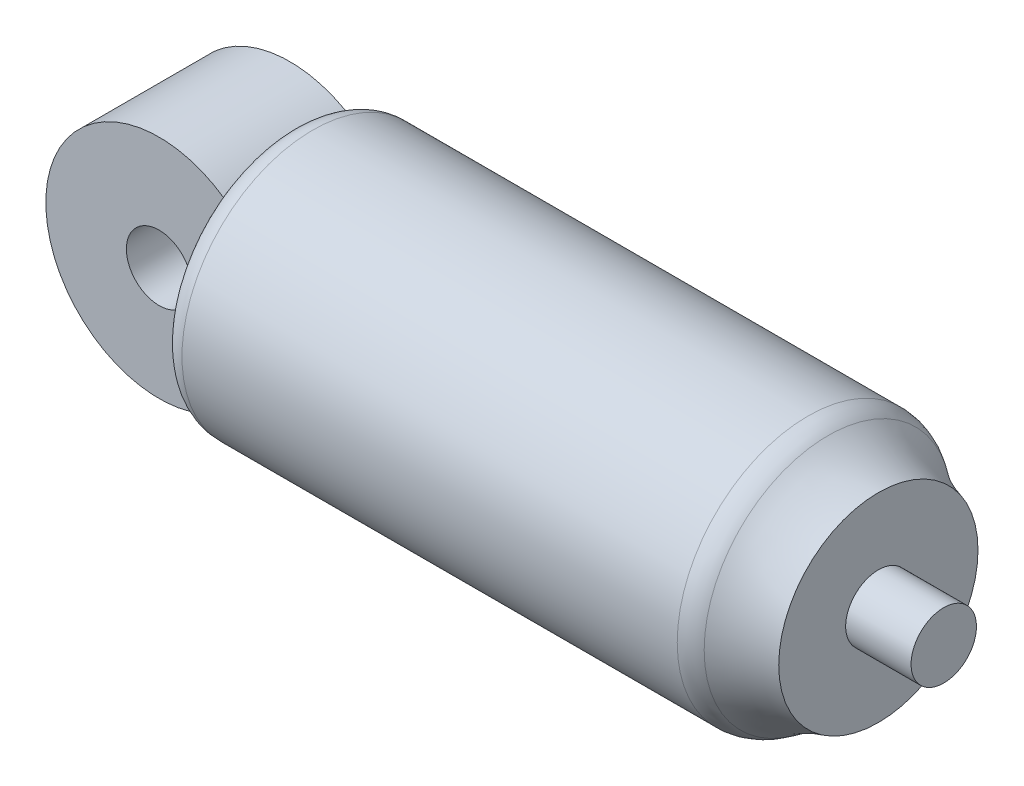
ISO-10303-21;
HEADER;
FILE_DESCRIPTION(('STEP AP214'),'2;1');
FILE_NAME('part.step','',(''),(''),'','','');
FILE_SCHEMA(('AUTOMOTIVE_DESIGN { 1 0 10303 214 1 1 1 1 }'));
ENDSEC;
DATA;
#1=APPLICATION_CONTEXT('core data for automotive mechanical design processes');
#2=APPLICATION_PROTOCOL_DEFINITION('international standard','automotive_design',2000,#1);
#3=PRODUCT_CONTEXT('',#1,'mechanical');
#4=PRODUCT('Part','Part','',(#3));
#5=PRODUCT_RELATED_PRODUCT_CATEGORY('part','',(#4));
#6=PRODUCT_DEFINITION_FORMATION('','',#4);
#7=PRODUCT_DEFINITION_CONTEXT('part definition',#1,'design');
#8=PRODUCT_DEFINITION('design','',#6,#7);
#9=PRODUCT_DEFINITION_SHAPE('','',#8);
#10=(LENGTH_UNIT() NAMED_UNIT(*) SI_UNIT(.MILLI.,.METRE.));
#11=(NAMED_UNIT(*) PLANE_ANGLE_UNIT() SI_UNIT($,.RADIAN.));
#12=(NAMED_UNIT(*) SI_UNIT($,.STERADIAN.) SOLID_ANGLE_UNIT());
#13=UNCERTAINTY_MEASURE_WITH_UNIT(LENGTH_MEASURE(1.E-05),#10,'distance_accuracy_value','');
#14=(GEOMETRIC_REPRESENTATION_CONTEXT(3) GLOBAL_UNCERTAINTY_ASSIGNED_CONTEXT((#13)) GLOBAL_UNIT_ASSIGNED_CONTEXT((#10,
#11,#12)) REPRESENTATION_CONTEXT('',''));
#15=CARTESIAN_POINT('',(0.,0.,0.));
#16=DIRECTION('',(0.,0.,1.));
#17=DIRECTION('',(1.,0.,0.));
#18=AXIS2_PLACEMENT_3D('',#15,#16,#17);
#19=CARTESIAN_POINT('',(20.,0.,20.));
#20=DIRECTION('',(1.,0.,0.));
#21=DIRECTION('',(0.,0.,-1.));
#22=AXIS2_PLACEMENT_3D('',#19,#20,#21);
#23=PLANE('',#22);
#24=DIRECTION('',(0.,1.,0.));
#25=VECTOR('',#24,1.);
#26=CARTESIAN_POINT('',(20.,0.,40.));
#27=LINE('',#26,#25);
#28=CARTESIAN_POINT('',(20.,-26.2488094968134,40.));
#29=VERTEX_POINT('',#28);
#30=CARTESIAN_POINT('',(20.,26.2488094968134,40.));
#31=VERTEX_POINT('',#30);
#32=EDGE_CURVE('E141',#29,#31,#27,.T.);
#33=ORIENTED_EDGE('',*,*,#32,.F.);
#34=CARTESIAN_POINT('',(20.,0.,20.));
#35=DIRECTION('',(1.,0.,0.));
#36=DIRECTION('',(0.,0.,-1.));
#37=AXIS2_PLACEMENT_3D('',#34,#35,#36);
#38=CIRCLE('',#37,33.);
#39=EDGE_CURVE('E173',#29,#31,#38,.F.);
#40=ORIENTED_EDGE('',*,*,#39,.T.);
#41=EDGE_LOOP('',(#33,#40));
#42=FACE_BOUND('',#41,.T.);
#43=ADVANCED_FACE('F44',(#42),#23,.F.);
#44=DIRECTION('',(0.,0.,-1.));
#45=VECTOR('',#44,1.);
#46=CARTESIAN_POINT('',(20.,28.2830267121466,40.));
#47=LINE('',#46,#45);
#48=CARTESIAN_POINT('',(20.,28.2830267121466,2.99792953784745));
#49=VERTEX_POINT('',#48);
#50=CARTESIAN_POINT('',(20.,28.2830267121466,37.0020704621526));
#51=VERTEX_POINT('',#50);
#52=EDGE_CURVE('E134',#49,#51,#47,.F.);
#53=ORIENTED_EDGE('',*,*,#52,.T.);
#54=CARTESIAN_POINT('',(20.,0.,20.));
#55=DIRECTION('',(1.,0.,0.));
#56=DIRECTION('',(0.,0.,-1.));
#57=AXIS2_PLACEMENT_3D('',#54,#55,#56);
#58=CIRCLE('',#57,33.);
#59=EDGE_CURVE('E171',#51,#49,#58,.F.);
#60=ORIENTED_EDGE('',*,*,#59,.T.);
#61=EDGE_LOOP('',(#53,#60));
#62=FACE_BOUND('',#61,.T.);
#63=ADVANCED_FACE('F256',(#62),#23,.F.);
#64=DIRECTION('',(0.,1.,0.));
#65=VECTOR('',#64,1.);
#66=CARTESIAN_POINT('',(20.,0.,0.));
#67=LINE('',#66,#65);
#68=CARTESIAN_POINT('',(20.,-26.2488094968134,0.));
#69=VERTEX_POINT('',#68);
#70=CARTESIAN_POINT('',(20.,26.2488094968134,0.));
#71=VERTEX_POINT('',#70);
#72=EDGE_CURVE('E150',#69,#71,#67,.T.);
#73=ORIENTED_EDGE('',*,*,#72,.T.);
#74=CARTESIAN_POINT('',(20.,0.,20.));
#75=DIRECTION('',(1.,0.,0.));
#76=DIRECTION('',(0.,0.,-1.));
#77=AXIS2_PLACEMENT_3D('',#74,#75,#76);
#78=CIRCLE('',#77,33.);
#79=EDGE_CURVE('E169',#71,#69,#78,.F.);
#80=ORIENTED_EDGE('',*,*,#79,.T.);
#81=EDGE_LOOP('',(#73,#80));
#82=FACE_BOUND('',#81,.T.);
#83=ADVANCED_FACE('F238',(#82),#23,.F.);
#84=CARTESIAN_POINT('',(20.,0.,20.));
#85=DIRECTION('',(1.,0.,0.));
#86=DIRECTION('',(0.,0.,-1.));
#87=AXIS2_PLACEMENT_3D('',#84,#85,#86);
#88=CYLINDRICAL_SURFACE('',#87,40.);
#89=CARTESIAN_POINT('',(27.,0.,20.));
#90=DIRECTION('',(1.,0.,0.));
#91=DIRECTION('',(0.,0.,-1.));
#92=AXIS2_PLACEMENT_3D('',#89,#90,#91);
#93=CIRCLE('',#92,40.);
#94=CARTESIAN_POINT('',(27.,0.,-20.));
#95=VERTEX_POINT('',#94);
#96=EDGE_CURVE('E164',#95,#95,#93,.T.);
#97=ORIENTED_EDGE('',*,*,#96,.T.);
#98=EDGE_LOOP('',(#97));
#99=FACE_BOUND('',#98,.T.);
#100=CARTESIAN_POINT('',(178.48120914175,0.,20.));
#101=DIRECTION('',(-1.,0.,0.));
#102=DIRECTION('',(0.,0.,1.));
#103=AXIS2_PLACEMENT_3D('',#100,#101,#102);
#104=CIRCLE('',#103,40.);
#105=CARTESIAN_POINT('',(178.48120914175,0.,60.));
#106=VERTEX_POINT('',#105);
#107=EDGE_CURVE('E161',#106,#106,#104,.T.);
#108=ORIENTED_EDGE('',*,*,#107,.T.);
#109=EDGE_LOOP('',(#108));
#110=FACE_BOUND('',#109,.T.);
#111=ADVANCED_FACE('F236',(#99,#110),#88,.T.);
#112=DIRECTION('',(0.,0.,-1.));
#113=VECTOR('',#112,1.);
#114=CARTESIAN_POINT('',(20.,-28.2830267121466,40.));
#115=LINE('',#114,#113);
#116=CARTESIAN_POINT('',(20.,-28.2830267121466,37.0020704621526));
#117=VERTEX_POINT('',#116);
#118=CARTESIAN_POINT('',(20.,-28.2830267121466,2.99792953784745));
#119=VERTEX_POINT('',#118);
#120=EDGE_CURVE('E147',#117,#119,#115,.T.);
#121=ORIENTED_EDGE('',*,*,#120,.T.);
#122=CARTESIAN_POINT('',(20.,0.,20.));
#123=DIRECTION('',(1.,0.,0.));
#124=DIRECTION('',(0.,0.,-1.));
#125=AXIS2_PLACEMENT_3D('',#122,#123,#124);
#126=CIRCLE('',#125,33.);
#127=EDGE_CURVE('E167',#119,#117,#126,.F.);
#128=ORIENTED_EDGE('',*,*,#127,.T.);
#129=EDGE_LOOP('',(#121,#128));
#130=FACE_BOUND('',#129,.T.);
#131=ADVANCED_FACE('F233',(#130),#23,.F.);
#132=CARTESIAN_POINT('',(40.,0.,0.));
#133=DIRECTION('',(-1.,0.,0.));
#134=DIRECTION('',(0.,0.,1.));
#135=AXIS2_PLACEMENT_3D('',#132,#133,#134);
#136=PLANE('',#135);
#137=DIRECTION('',(0.,-1.,0.));
#138=VECTOR('',#137,1.);
#139=CARTESIAN_POINT('',(40.,28.2830267121466,0.));
#140=LINE('',#139,#138);
#141=CARTESIAN_POINT('',(40.,28.2830267121466,0.));
#142=VERTEX_POINT('',#141);
#143=CARTESIAN_POINT('',(40.,-28.2830267121466,0.));
#144=VERTEX_POINT('',#143);
#145=EDGE_CURVE('E127',#142,#144,#140,.T.);
#146=ORIENTED_EDGE('',*,*,#145,.T.);
#147=DIRECTION('',(0.,0.,1.));
#148=VECTOR('',#147,1.);
#149=CARTESIAN_POINT('',(40.,-28.2830267121466,0.));
#150=LINE('',#149,#148);
#151=CARTESIAN_POINT('',(40.,-28.2830267121466,40.));
#152=VERTEX_POINT('',#151);
#153=EDGE_CURVE('E133',#144,#152,#150,.T.);
#154=ORIENTED_EDGE('',*,*,#153,.T.);
#155=DIRECTION('',(0.,1.,0.));
#156=VECTOR('',#155,1.);
#157=CARTESIAN_POINT('',(40.,28.2830267121466,40.));
#158=LINE('',#157,#156);
#159=CARTESIAN_POINT('',(40.,28.2830267121466,40.));
#160=VERTEX_POINT('',#159);
#161=EDGE_CURVE('E139',#152,#160,#158,.T.);
#162=ORIENTED_EDGE('',*,*,#161,.T.);
#163=DIRECTION('',(0.,0.,-1.));
#164=VECTOR('',#163,1.);
#165=CARTESIAN_POINT('',(40.,28.2830267121466,0.));
#166=LINE('',#165,#164);
#167=EDGE_CURVE('E121',#160,#142,#166,.T.);
#168=ORIENTED_EDGE('',*,*,#167,.T.);
#169=EDGE_LOOP('',(#146,#154,#162,#168));
#170=FACE_BOUND('',#169,.T.);
#171=ADVANCED_FACE('F137',(#170),#136,.T.);
#172=CARTESIAN_POINT('',(40.,-28.2830267121466,0.));
#173=DIRECTION('',(0.,-1.,0.));
#174=DIRECTION('',(0.,0.,-1.));
#175=AXIS2_PLACEMENT_3D('',#172,#173,#174);
#176=PLANE('',#175);
#177=DIRECTION('',(-1.,0.,0.));
#178=VECTOR('',#177,1.);
#179=CARTESIAN_POINT('',(40.,-28.2830267121466,0.));
#180=LINE('',#179,#178);
#181=CARTESIAN_POINT('',(20.1948254981962,-28.2830267121466,0.));
#182=VERTEX_POINT('',#181);
#183=EDGE_CURVE('E129',#144,#182,#180,.T.);
#184=ORIENTED_EDGE('',*,*,#183,.T.);
#185=CARTESIAN_POINT('',(20.1948254981962,-28.2830267121466,0.));
#186=CARTESIAN_POINT('',(20.160279238848,-28.2830267121466,0.248355444867538));
#187=CARTESIAN_POINT('',(20.1308419637385,-28.2830267121466,0.497386874252565));
#188=CARTESIAN_POINT('',(20.0814099693617,-28.2830267121466,0.996091238378469));
#189=CARTESIAN_POINT('',(20.0614040583334,-28.2830267121466,1.24576305749517));
#190=CARTESIAN_POINT('',(20.0299838221906,-28.2830267121466,1.74558608946365));
#191=CARTESIAN_POINT('',(20.0185679668843,-28.2830267121466,1.9957372089719));
#192=CARTESIAN_POINT('',(20.0035744241917,-28.2830267121466,2.49657628750591));
#193=CARTESIAN_POINT('',(20.0000060854123,-28.2830267121466,2.74726453109424));
#194=CARTESIAN_POINT('',(20.,-28.2830267121466,2.99792953784745));
#195=B_SPLINE_CURVE_WITH_KNOTS('',3,(#185,#186,#187,#188,#189,#190,#191,#192,#193,#194),
.UNSPECIFIED.,.F.,.F.,(4,2,2,2,4),(0.,0.752137689927841,1.50338059234582,2.25448964022429,
3.00649298735349),.UNSPECIFIED.);
#196=EDGE_CURVE('E49',#182,#119,#195,.T.);
#197=ORIENTED_EDGE('',*,*,#196,.T.);
#198=ORIENTED_EDGE('',*,*,#120,.F.);
#199=CARTESIAN_POINT('',(20.,-28.2830267121466,37.0020704621526));
#200=CARTESIAN_POINT('',(20.0000060854123,-28.2830267121466,37.2527354689058));
#201=CARTESIAN_POINT('',(20.0035744241917,-28.2830267121466,37.5034237124941));
#202=CARTESIAN_POINT('',(20.0185679668843,-28.2830267121466,38.0042627910281));
#203=CARTESIAN_POINT('',(20.0299838221906,-28.2830267121466,38.2544139105363));
#204=CARTESIAN_POINT('',(20.0614040583334,-28.2830267121466,38.7542369425048));
#205=CARTESIAN_POINT('',(20.0814099693617,-28.2830267121466,39.0039087616215));
#206=CARTESIAN_POINT('',(20.1308419637385,-28.2830267121466,39.5026131257474));
#207=CARTESIAN_POINT('',(20.160279238848,-28.2830267121466,39.7516445551325));
#208=CARTESIAN_POINT('',(20.1948254981962,-28.2830267121466,40.));
#209=B_SPLINE_CURVE_WITH_KNOTS('',3,(#199,#200,#201,#202,#203,#204,#205,#206,#207,#208),
.UNSPECIFIED.,.F.,.F.,(4,2,2,2,4),(0.,0.7520033471292,1.50311239500766,2.25435529742564,
3.00649298735349),.UNSPECIFIED.);
#210=CARTESIAN_POINT('',(20.1948254981962,-28.2830267121466,40.));
#211=VERTEX_POINT('',#210);
#212=EDGE_CURVE('E284',#117,#211,#209,.T.);
#213=ORIENTED_EDGE('',*,*,#212,.T.);
#214=DIRECTION('',(-1.,0.,0.));
#215=VECTOR('',#214,1.);
#216=CARTESIAN_POINT('',(40.,-28.2830267121466,40.));
#217=LINE('',#216,#215);
#218=EDGE_CURVE('E156',#152,#211,#217,.T.);
#219=ORIENTED_EDGE('',*,*,#218,.F.);
#220=ORIENTED_EDGE('',*,*,#153,.F.);
#221=EDGE_LOOP('',(#184,#197,#198,#213,#219,#220));
#222=FACE_BOUND('',#221,.T.);
#223=ADVANCED_FACE('F193',(#222),#176,.F.);
#224=CARTESIAN_POINT('',(40.,28.2830267121466,40.));
#225=DIRECTION('',(0.,0.,1.));
#226=DIRECTION('',(1.,0.,0.));
#227=AXIS2_PLACEMENT_3D('',#224,#225,#226);
#228=PLANE('',#227);
#229=ORIENTED_EDGE('',*,*,#32,.T.);
#230=CARTESIAN_POINT('',(20.,26.2488094968134,40.));
#231=CARTESIAN_POINT('',(20.0000004890266,26.4195581899161,40.));
#232=CARTESIAN_POINT('',(20.003952907949,26.5903159501761,40.));
#233=CARTESIAN_POINT('',(20.0199173343197,26.9310506482777,40.));
#234=CARTESIAN_POINT('',(20.0319103850597,27.1010284780561,40.));
#235=CARTESIAN_POINT('',(20.0641116427262,27.4402254462618,40.));
#236=CARTESIAN_POINT('',(20.0843205787439,27.6094445160077,40.));
#237=CARTESIAN_POINT('',(20.133182028721,27.9470642154494,40.));
#238=CARTESIAN_POINT('',(20.1618543162975,28.1154619790185,40.));
#239=CARTESIAN_POINT('',(20.1948254981962,28.2830267121466,40.));
#240=B_SPLINE_CURVE_WITH_KNOTS('',3,(#230,#231,#232,#233,#234,#235,#236,#237,#238,#239),
.UNSPECIFIED.,.F.,.F.,(4,2,2,2,4),(0.,0.512213453390982,1.0232235318383,1.53427896805816,
2.04653800535891),.UNSPECIFIED.);
#241=CARTESIAN_POINT('',(20.1948254981962,28.2830267121466,40.));
#242=VERTEX_POINT('',#241);
#243=EDGE_CURVE('E183',#31,#242,#240,.T.);
#244=ORIENTED_EDGE('',*,*,#243,.T.);
#245=DIRECTION('',(-1.,0.,0.));
#246=VECTOR('',#245,1.);
#247=CARTESIAN_POINT('',(40.,28.2830267121466,40.));
#248=LINE('',#247,#246);
#249=EDGE_CURVE('E124',#160,#242,#248,.T.);
#250=ORIENTED_EDGE('',*,*,#249,.F.);
#251=ORIENTED_EDGE('',*,*,#161,.F.);
#252=ORIENTED_EDGE('',*,*,#218,.T.);
#253=CARTESIAN_POINT('',(20.1948254981962,-28.2830267121466,40.));
#254=CARTESIAN_POINT('',(20.1618543162975,-28.1154619790185,40.));
#255=CARTESIAN_POINT('',(20.133182028721,-27.9470642154494,40.));
#256=CARTESIAN_POINT('',(20.0843205787439,-27.6094445160077,40.));
#257=CARTESIAN_POINT('',(20.0641116427262,-27.4402254462618,40.));
#258=CARTESIAN_POINT('',(20.0319103850597,-27.1010284780561,40.));
#259=CARTESIAN_POINT('',(20.0199173343197,-26.9310506482777,40.));
#260=CARTESIAN_POINT('',(20.003952907949,-26.5903159501761,40.));
#261=CARTESIAN_POINT('',(20.0000004890266,-26.4195581899161,40.));
#262=CARTESIAN_POINT('',(20.,-26.2488094968134,40.));
#263=B_SPLINE_CURVE_WITH_KNOTS('',3,(#253,#254,#255,#256,#257,#258,#259,#260,#261,#262),
.UNSPECIFIED.,.F.,.F.,(4,2,2,2,4),(0.,0.512259037300747,1.02331447352061,1.53432455196793,
2.04653800535891),.UNSPECIFIED.);
#264=EDGE_CURVE('E176',#211,#29,#263,.T.);
#265=ORIENTED_EDGE('',*,*,#264,.T.);
#266=EDGE_LOOP('',(#229,#244,#250,#251,#252,#265));
#267=FACE_BOUND('',#266,.T.);
#268=ADVANCED_FACE('F189',(#267),#228,.F.);
#269=CARTESIAN_POINT('',(40.,28.2830267121466,0.));
#270=DIRECTION('',(0.,1.,0.));
#271=DIRECTION('',(0.,0.,1.));
#272=AXIS2_PLACEMENT_3D('',#269,#270,#271);
#273=PLANE('',#272);
#274=ORIENTED_EDGE('',*,*,#249,.T.);
#275=CARTESIAN_POINT('',(20.1948254981962,28.2830267121466,40.));
#276=CARTESIAN_POINT('',(20.160279238848,28.2830267121466,39.7516445551325));
#277=CARTESIAN_POINT('',(20.1308419637385,28.2830267121466,39.5026131257474));
#278=CARTESIAN_POINT('',(20.0814099693617,28.2830267121466,39.0039087616215));
#279=CARTESIAN_POINT('',(20.0614040583334,28.2830267121466,38.7542369425048));
#280=CARTESIAN_POINT('',(20.0299838221906,28.2830267121466,38.2544139105363));
#281=CARTESIAN_POINT('',(20.0185679668843,28.2830267121466,38.0042627910281));
#282=CARTESIAN_POINT('',(20.0035744241917,28.2830267121466,37.5034237124941));
#283=CARTESIAN_POINT('',(20.0000060854123,28.2830267121466,37.2527354689058));
#284=CARTESIAN_POINT('',(20.,28.2830267121466,37.0020704621526));
#285=B_SPLINE_CURVE_WITH_KNOTS('',3,(#275,#276,#277,#278,#279,#280,#281,#282,#283,#284),
.UNSPECIFIED.,.F.,.F.,(4,2,2,2,4),(0.,0.752137689927853,1.50338059234583,2.25448964022429,
3.00649298735349),.UNSPECIFIED.);
#286=EDGE_CURVE('E207',#242,#51,#285,.T.);
#287=ORIENTED_EDGE('',*,*,#286,.T.);
#288=ORIENTED_EDGE('',*,*,#52,.F.);
#289=CARTESIAN_POINT('',(20.,28.2830267121466,2.99792953784745));
#290=CARTESIAN_POINT('',(20.0000060854123,28.2830267121466,2.74726453109424));
#291=CARTESIAN_POINT('',(20.0035744241917,28.2830267121466,2.49657628750591));
#292=CARTESIAN_POINT('',(20.0185679668843,28.2830267121466,1.9957372089719));
#293=CARTESIAN_POINT('',(20.0299838221906,28.2830267121466,1.74558608946365));
#294=CARTESIAN_POINT('',(20.0614040583334,28.2830267121466,1.24576305749517));
#295=CARTESIAN_POINT('',(20.0814099693617,28.2830267121466,0.996091238378469));
#296=CARTESIAN_POINT('',(20.1308419637385,28.2830267121466,0.497386874252564));
#297=CARTESIAN_POINT('',(20.160279238848,28.2830267121466,0.248355444867538));
#298=CARTESIAN_POINT('',(20.1948254981962,28.2830267121466,0.));
#299=B_SPLINE_CURVE_WITH_KNOTS('',3,(#289,#290,#291,#292,#293,#294,#295,#296,#297,#298),
.UNSPECIFIED.,.F.,.F.,(4,2,2,2,4),(0.,0.7520033471292,1.50311239500767,2.25435529742565,
3.00649298735349),.UNSPECIFIED.);
#300=CARTESIAN_POINT('',(20.1948254981962,28.2830267121466,0.));
#301=VERTEX_POINT('',#300);
#302=EDGE_CURVE('E74',#49,#301,#299,.T.);
#303=ORIENTED_EDGE('',*,*,#302,.T.);
#304=DIRECTION('',(-1.,0.,0.));
#305=VECTOR('',#304,1.);
#306=CARTESIAN_POINT('',(40.,28.2830267121466,0.));
#307=LINE('',#306,#305);
#308=EDGE_CURVE('E116',#142,#301,#307,.T.);
#309=ORIENTED_EDGE('',*,*,#308,.F.);
#310=ORIENTED_EDGE('',*,*,#167,.F.);
#311=EDGE_LOOP('',(#274,#287,#288,#303,#309,#310));
#312=FACE_BOUND('',#311,.T.);
#313=ADVANCED_FACE('F119',(#312),#273,.F.);
#314=CARTESIAN_POINT('',(40.,28.2830267121466,0.));
#315=DIRECTION('',(0.,0.,-1.));
#316=DIRECTION('',(-1.,0.,0.));
#317=AXIS2_PLACEMENT_3D('',#314,#315,#316);
#318=PLANE('',#317);
#319=ORIENTED_EDGE('',*,*,#308,.T.);
#320=CARTESIAN_POINT('',(20.1948254981962,28.2830267121466,0.));
#321=CARTESIAN_POINT('',(20.1618543162975,28.1154619790185,0.));
#322=CARTESIAN_POINT('',(20.133182028721,27.9470642154494,0.));
#323=CARTESIAN_POINT('',(20.0843205787439,27.6094445160077,0.));
#324=CARTESIAN_POINT('',(20.0641116427262,27.4402254462618,0.));
#325=CARTESIAN_POINT('',(20.0319103850597,27.1010284780561,0.));
#326=CARTESIAN_POINT('',(20.0199173343197,26.9310506482777,0.));
#327=CARTESIAN_POINT('',(20.003952907949,26.5903159501761,0.));
#328=CARTESIAN_POINT('',(20.0000004890266,26.4195581899161,0.));
#329=CARTESIAN_POINT('',(20.,26.2488094968134,0.));
#330=B_SPLINE_CURVE_WITH_KNOTS('',3,(#320,#321,#322,#323,#324,#325,#326,#327,#328,#329),
.UNSPECIFIED.,.F.,.F.,(4,2,2,2,4),(0.,0.512259037300747,1.02331447352061,1.53432455196793,
2.04653800535891),.UNSPECIFIED.);
#331=EDGE_CURVE('E218',#301,#71,#330,.T.);
#332=ORIENTED_EDGE('',*,*,#331,.T.);
#333=ORIENTED_EDGE('',*,*,#72,.F.);
#334=CARTESIAN_POINT('',(20.,-26.2488094968134,0.));
#335=CARTESIAN_POINT('',(20.0000004890266,-26.4195581899161,0.));
#336=CARTESIAN_POINT('',(20.003952907949,-26.5903159501761,0.));
#337=CARTESIAN_POINT('',(20.0199173343197,-26.9310506482777,0.));
#338=CARTESIAN_POINT('',(20.0319103850597,-27.1010284780561,0.));
#339=CARTESIAN_POINT('',(20.0641116427262,-27.4402254462618,0.));
#340=CARTESIAN_POINT('',(20.0843205787439,-27.6094445160077,0.));
#341=CARTESIAN_POINT('',(20.133182028721,-27.9470642154494,0.));
#342=CARTESIAN_POINT('',(20.1618543162975,-28.1154619790185,0.));
#343=CARTESIAN_POINT('',(20.1948254981962,-28.2830267121466,0.));
#344=B_SPLINE_CURVE_WITH_KNOTS('',3,(#334,#335,#336,#337,#338,#339,#340,#341,#342,#343),
.UNSPECIFIED.,.F.,.F.,(4,2,2,2,4),(0.,0.512213453390982,1.0232235318383,1.53427896805816,
2.04653800535891),.UNSPECIFIED.);
#345=EDGE_CURVE('E66',#69,#182,#344,.T.);
#346=ORIENTED_EDGE('',*,*,#345,.T.);
#347=ORIENTED_EDGE('',*,*,#183,.F.);
#348=ORIENTED_EDGE('',*,*,#145,.F.);
#349=EDGE_LOOP('',(#319,#332,#333,#346,#347,#348));
#350=FACE_BOUND('',#349,.T.);
#351=ADVANCED_FACE('F128',(#350),#318,.F.);
#352=CARTESIAN_POINT('',(209.599101879112,0.,20.));
#353=DIRECTION('',(1.,0.,0.));
#354=DIRECTION('',(0.,0.,-1.));
#355=AXIS2_PLACEMENT_3D('',#352,#353,#354);
#356=TOROIDAL_SURFACE('',#355,70.0251363396509,40.6984692808533);
#357=CARTESIAN_POINT('',(184.619045880958,0.,20.));
#358=DIRECTION('',(1.,0.,0.));
#359=DIRECTION('',(0.,0.,-1.));
#360=AXIS2_PLACEMENT_3D('',#357,#358,#359);
#361=CIRCLE('',#360,37.8947425646965);
#362=CARTESIAN_POINT('',(184.619045880958,0.,-17.8947425646965));
#363=VERTEX_POINT('',#362);
#364=EDGE_CURVE('E123',#363,#363,#361,.T.);
#365=ORIENTED_EDGE('',*,*,#364,.T.);
#366=EDGE_LOOP('',(#365));
#367=FACE_BOUND('',#366,.T.);
#368=CARTESIAN_POINT('',(200.,0.,20.));
#369=DIRECTION('',(1.,0.,0.));
#370=DIRECTION('',(0.,0.,-1.));
#371=AXIS2_PLACEMENT_3D('',#368,#369,#370);
#372=CIRCLE('',#371,30.4748816638718);
#373=CARTESIAN_POINT('',(200.,0.,-10.4748816638718));
#374=VERTEX_POINT('',#373);
#375=EDGE_CURVE('E151',#374,#374,#372,.T.);
#376=ORIENTED_EDGE('',*,*,#375,.F.);
#377=EDGE_LOOP('',(#376));
#378=FACE_BOUND('',#377,.T.);
#379=ADVANCED_FACE('F226',(#367,#378),#356,.F.);
#380=CARTESIAN_POINT('',(200.,0.,20.));
#381=DIRECTION('',(1.,0.,0.));
#382=DIRECTION('',(0.,0.,-1.));
#383=AXIS2_PLACEMENT_3D('',#380,#381,#382);
#384=PLANE('',#383);
#385=CARTESIAN_POINT('',(200.,0.,20.));
#386=DIRECTION('',(1.,0.,0.));
#387=DIRECTION('',(0.,0.,-1.));
#388=AXIS2_PLACEMENT_3D('',#385,#386,#387);
#389=CIRCLE('',#388,10.);
#390=CARTESIAN_POINT('',(200.,0.,10.));
#391=VERTEX_POINT('',#390);
#392=EDGE_CURVE('E12',#391,#391,#389,.T.);
#393=ORIENTED_EDGE('',*,*,#392,.F.);
#394=EDGE_LOOP('',(#393));
#395=FACE_BOUND('',#394,.T.);
#396=ORIENTED_EDGE('',*,*,#375,.T.);
#397=EDGE_LOOP('',(#396));
#398=FACE_BOUND('',#397,.T.);
#399=ADVANCED_FACE('F227',(#395,#398),#384,.T.);
#400=CARTESIAN_POINT('',(178.48120914175,0.,20.));
#401=DIRECTION('',(-1.,0.,0.));
#402=DIRECTION('',(0.,0.,1.));
#403=AXIS2_PLACEMENT_3D('',#400,#401,#402);
#404=TOROIDAL_SURFACE('',#403,30.,10.);
#405=ORIENTED_EDGE('',*,*,#107,.F.);
#406=EDGE_LOOP('',(#405));
#407=FACE_BOUND('',#406,.T.);
#408=ORIENTED_EDGE('',*,*,#364,.F.);
#409=EDGE_LOOP('',(#408));
#410=FACE_BOUND('',#409,.T.);
#411=ADVANCED_FACE('F231',(#407,#410),#404,.T.);
#412=CARTESIAN_POINT('',(27.,0.,20.));
#413=DIRECTION('',(1.,0.,0.));
#414=DIRECTION('',(0.,0.,-1.));
#415=AXIS2_PLACEMENT_3D('',#412,#413,#414);
#416=TOROIDAL_SURFACE('',#415,33.,7.);
#417=ORIENTED_EDGE('',*,*,#243,.F.);
#418=ORIENTED_EDGE('',*,*,#39,.F.);
#419=ORIENTED_EDGE('',*,*,#264,.F.);
#420=ORIENTED_EDGE('',*,*,#212,.F.);
#421=ORIENTED_EDGE('',*,*,#127,.F.);
#422=ORIENTED_EDGE('',*,*,#196,.F.);
#423=ORIENTED_EDGE('',*,*,#345,.F.);
#424=ORIENTED_EDGE('',*,*,#79,.F.);
#425=ORIENTED_EDGE('',*,*,#331,.F.);
#426=ORIENTED_EDGE('',*,*,#302,.F.);
#427=ORIENTED_EDGE('',*,*,#59,.F.);
#428=ORIENTED_EDGE('',*,*,#286,.F.);
#429=EDGE_LOOP('',(#417,#418,#419,#420,#421,#422,#423,#424,#425,#426,#427,#428));
#430=FACE_BOUND('',#429,.T.);
#431=ORIENTED_EDGE('',*,*,#96,.F.);
#432=EDGE_LOOP('',(#431));
#433=FACE_BOUND('',#432,.T.);
#434=ADVANCED_FACE('F46',(#430,#433),#416,.T.);
#435=CARTESIAN_POINT('',(220.,0.,20.));
#436=DIRECTION('',(-1.,0.,0.));
#437=DIRECTION('',(0.,0.,1.));
#438=AXIS2_PLACEMENT_3D('',#435,#436,#437);
#439=CYLINDRICAL_SURFACE('',#438,10.);
#440=CARTESIAN_POINT('',(220.,0.,20.));
#441=DIRECTION('',(1.,0.,0.));
#442=DIRECTION('',(0.,0.,-1.));
#443=AXIS2_PLACEMENT_3D('',#440,#441,#442);
#444=CIRCLE('',#443,10.);
#445=CARTESIAN_POINT('',(220.,0.,10.));
#446=VERTEX_POINT('',#445);
#447=EDGE_CURVE('E274',#446,#446,#444,.T.);
#448=ORIENTED_EDGE('',*,*,#447,.F.);
#449=EDGE_LOOP('',(#448));
#450=FACE_BOUND('',#449,.T.);
#451=ORIENTED_EDGE('',*,*,#392,.T.);
#452=EDGE_LOOP('',(#451));
#453=FACE_BOUND('',#452,.T.);
#454=ADVANCED_FACE('F245',(#450,#453),#439,.T.);
#455=CARTESIAN_POINT('',(220.,0.,20.));
#456=DIRECTION('',(1.,0.,0.));
#457=DIRECTION('',(0.,0.,-1.));
#458=AXIS2_PLACEMENT_3D('',#455,#456,#457);
#459=PLANE('',#458);
#460=ORIENTED_EDGE('',*,*,#447,.T.);
#461=EDGE_LOOP('',(#460));
#462=FACE_BOUND('',#461,.T.);
#463=ADVANCED_FACE('F248',(#462),#459,.T.);
#464=CLOSED_SHELL('',(#43,#63,#83,#111,#131,#171,#223,#268,#313,#351,#379,#399,#411,#434,#454,#463));
#465=MANIFOLD_SOLID_BREP('B2',#464);
#466=CARTESIAN_POINT('',(0.,0.,40.));
#467=DIRECTION('',(0.,0.,-1.));
#468=DIRECTION('',(-1.,0.,0.));
#469=AXIS2_PLACEMENT_3D('',#466,#467,#468);
#470=CYLINDRICAL_SURFACE('',#469,10.);
#471=CARTESIAN_POINT('',(0.,0.,40.));
#472=DIRECTION('',(0.,0.,1.));
#473=DIRECTION('',(1.,0.,0.));
#474=AXIS2_PLACEMENT_3D('',#471,#472,#473);
#475=CIRCLE('',#474,10.);
#476=CARTESIAN_POINT('',(10.,0.,40.));
#477=VERTEX_POINT('',#476);
#478=EDGE_CURVE('E441',#477,#477,#475,.T.);
#479=ORIENTED_EDGE('',*,*,#478,.T.);
#480=EDGE_LOOP('',(#479));
#481=FACE_BOUND('',#480,.T.);
#482=CARTESIAN_POINT('',(0.,0.,0.));
#483=DIRECTION('',(0.,0.,1.));
#484=DIRECTION('',(1.,0.,0.));
#485=AXIS2_PLACEMENT_3D('',#482,#483,#484);
#486=CIRCLE('',#485,10.);
#487=CARTESIAN_POINT('',(10.,0.,0.));
#488=VERTEX_POINT('',#487);
#489=EDGE_CURVE('E444',#488,#488,#486,.T.);
#490=ORIENTED_EDGE('',*,*,#489,.F.);
#491=EDGE_LOOP('',(#490));
#492=FACE_BOUND('',#491,.T.);
#493=ADVANCED_FACE('F406',(#481,#492),#470,.F.);
#494=CARTESIAN_POINT('',(0.,0.,40.));
#495=DIRECTION('',(0.,0.,-1.));
#496=DIRECTION('',(-1.,0.,0.));
#497=AXIS2_PLACEMENT_3D('',#494,#495,#496);
#498=CYLINDRICAL_SURFACE('',#497,34.64);
#499=DIRECTION('',(0.,0.,-1.));
#500=VECTOR('',#499,1.);
#501=CARTESIAN_POINT('',(20.,-28.2830267121466,40.));
#502=LINE('',#501,#500);
#503=CARTESIAN_POINT('',(20.,-28.2830267121466,40.));
#504=VERTEX_POINT('',#503);
#505=CARTESIAN_POINT('',(20.,-28.2830267121466,0.));
#506=VERTEX_POINT('',#505);
#507=EDGE_CURVE('E42',#504,#506,#502,.T.);
#508=ORIENTED_EDGE('',*,*,#507,.F.);
#509=CARTESIAN_POINT('',(0.,0.,40.));
#510=DIRECTION('',(0.,0.,1.));
#511=DIRECTION('',(1.,0.,0.));
#512=AXIS2_PLACEMENT_3D('',#509,#510,#511);
#513=CIRCLE('',#512,34.64);
#514=CARTESIAN_POINT('',(20.,28.2830267121466,40.));
#515=VERTEX_POINT('',#514);
#516=EDGE_CURVE('E439',#515,#504,#513,.T.);
#517=ORIENTED_EDGE('',*,*,#516,.F.);
#518=DIRECTION('',(0.,0.,-1.));
#519=VECTOR('',#518,1.);
#520=CARTESIAN_POINT('',(20.,28.2830267121466,40.));
#521=LINE('',#520,#519);
#522=CARTESIAN_POINT('',(20.,28.2830267121466,0.));
#523=VERTEX_POINT('',#522);
#524=EDGE_CURVE('E440',#523,#515,#521,.F.);
#525=ORIENTED_EDGE('',*,*,#524,.F.);
#526=CARTESIAN_POINT('',(0.,0.,0.));
#527=DIRECTION('',(0.,0.,1.));
#528=DIRECTION('',(1.,0.,0.));
#529=AXIS2_PLACEMENT_3D('',#526,#527,#528);
#530=CIRCLE('',#529,34.64);
#531=EDGE_CURVE('E437',#523,#506,#530,.T.);
#532=ORIENTED_EDGE('',*,*,#531,.T.);
#533=EDGE_LOOP('',(#508,#517,#525,#532));
#534=FACE_BOUND('',#533,.T.);
#535=ADVANCED_FACE('F408',(#534),#498,.T.);
#536=CARTESIAN_POINT('',(0.,0.,40.));
#537=DIRECTION('',(0.,0.,1.));
#538=DIRECTION('',(1.,0.,0.));
#539=AXIS2_PLACEMENT_3D('',#536,#537,#538);
#540=PLANE('',#539);
#541=ORIENTED_EDGE('',*,*,#478,.F.);
#542=EDGE_LOOP('',(#541));
#543=FACE_BOUND('',#542,.T.);
#544=ORIENTED_EDGE('',*,*,#516,.T.);
#545=DIRECTION('',(0.,1.,0.));
#546=VECTOR('',#545,1.);
#547=CARTESIAN_POINT('',(20.,0.,40.));
#548=LINE('',#547,#546);
#549=EDGE_CURVE('E421',#504,#515,#548,.T.);
#550=ORIENTED_EDGE('',*,*,#549,.T.);
#551=EDGE_LOOP('',(#544,#550));
#552=FACE_BOUND('',#551,.T.);
#553=ADVANCED_FACE('F451',(#543,#552),#540,.T.);
#554=CARTESIAN_POINT('',(0.,0.,0.));
#555=DIRECTION('',(0.,0.,1.));
#556=DIRECTION('',(1.,0.,0.));
#557=AXIS2_PLACEMENT_3D('',#554,#555,#556);
#558=PLANE('',#557);
#559=ORIENTED_EDGE('',*,*,#489,.T.);
#560=EDGE_LOOP('',(#559));
#561=FACE_BOUND('',#560,.T.);
#562=DIRECTION('',(0.,1.,0.));
#563=VECTOR('',#562,1.);
#564=CARTESIAN_POINT('',(20.,0.,0.));
#565=LINE('',#564,#563);
#566=EDGE_CURVE('E410',#506,#523,#565,.T.);
#567=ORIENTED_EDGE('',*,*,#566,.F.);
#568=ORIENTED_EDGE('',*,*,#531,.F.);
#569=EDGE_LOOP('',(#567,#568));
#570=FACE_BOUND('',#569,.T.);
#571=ADVANCED_FACE('F436',(#561,#570),#558,.F.);
#572=CARTESIAN_POINT('',(20.,0.,0.));
#573=DIRECTION('',(-1.,0.,0.));
#574=DIRECTION('',(0.,0.,1.));
#575=AXIS2_PLACEMENT_3D('',#572,#573,#574);
#576=PLANE('',#575);
#577=ORIENTED_EDGE('',*,*,#566,.T.);
#578=ORIENTED_EDGE('',*,*,#524,.T.);
#579=ORIENTED_EDGE('',*,*,#549,.F.);
#580=ORIENTED_EDGE('',*,*,#507,.T.);
#581=EDGE_LOOP('',(#577,#578,#579,#580));
#582=FACE_BOUND('',#581,.T.);
#583=ADVANCED_FACE('F431',(#582),#576,.F.);
#584=CLOSED_SHELL('',(#493,#535,#553,#571,#583));
#585=MANIFOLD_SOLID_BREP('B6',#584);
#586=ADVANCED_BREP_SHAPE_REPRESENTATION('',(#18,#465,#585),#14);
#587=SHAPE_DEFINITION_REPRESENTATION(#9,#586);
ENDSEC;
END-ISO-10303-21;
